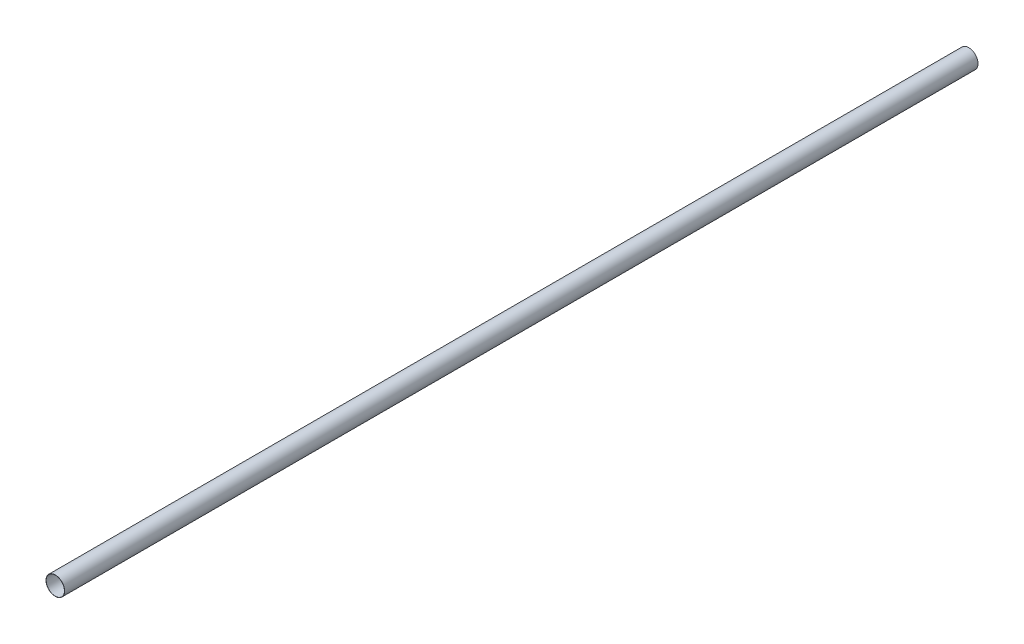
ISO-10303-21;
HEADER;
FILE_DESCRIPTION(('STEP AP214'),'2;1');
FILE_NAME('part.step','',(''),(''),'','','');
FILE_SCHEMA(('AUTOMOTIVE_DESIGN { 1 0 10303 214 1 1 1 1 }'));
ENDSEC;
DATA;
#1=APPLICATION_CONTEXT('core data for automotive mechanical design processes');
#2=APPLICATION_PROTOCOL_DEFINITION('international standard','automotive_design',2000,#1);
#3=PRODUCT_CONTEXT('',#1,'mechanical');
#4=PRODUCT('Part','Part','',(#3));
#5=PRODUCT_RELATED_PRODUCT_CATEGORY('part','',(#4));
#6=PRODUCT_DEFINITION_FORMATION('','',#4);
#7=PRODUCT_DEFINITION_CONTEXT('part definition',#1,'design');
#8=PRODUCT_DEFINITION('design','',#6,#7);
#9=PRODUCT_DEFINITION_SHAPE('','',#8);
#10=(LENGTH_UNIT() NAMED_UNIT(*) SI_UNIT(.MILLI.,.METRE.));
#11=(NAMED_UNIT(*) PLANE_ANGLE_UNIT() SI_UNIT($,.RADIAN.));
#12=(NAMED_UNIT(*) SI_UNIT($,.STERADIAN.) SOLID_ANGLE_UNIT());
#13=UNCERTAINTY_MEASURE_WITH_UNIT(LENGTH_MEASURE(1.E-05),#10,'distance_accuracy_value','');
#14=(GEOMETRIC_REPRESENTATION_CONTEXT(3) GLOBAL_UNCERTAINTY_ASSIGNED_CONTEXT((#13)) GLOBAL_UNIT_ASSIGNED_CONTEXT((#10,
#11,#12)) REPRESENTATION_CONTEXT('',''));
#15=CARTESIAN_POINT('',(0.,0.,0.));
#16=DIRECTION('',(0.,0.,1.));
#17=DIRECTION('',(1.,0.,0.));
#18=AXIS2_PLACEMENT_3D('',#15,#16,#17);
#19=CARTESIAN_POINT('',(0.,0.,5000.));
#20=DIRECTION('',(0.,0.,1.));
#21=DIRECTION('',(1.,0.,0.));
#22=AXIS2_PLACEMENT_3D('',#19,#20,#21);
#23=PLANE('',#22);
#24=CARTESIAN_POINT('',(0.,0.,5000.));
#25=DIRECTION('',(0.,0.,1.));
#26=DIRECTION('',(1.,0.,0.));
#27=AXIS2_PLACEMENT_3D('',#24,#25,#26);
#28=CIRCLE('',#27,51.);
#29=CARTESIAN_POINT('',(51.,0.,5000.));
#30=VERTEX_POINT('',#29);
#31=EDGE_CURVE('E10',#30,#30,#28,.T.);
#32=ORIENTED_EDGE('',*,*,#31,.T.);
#33=EDGE_LOOP('',(#32));
#34=FACE_BOUND('',#33,.T.);
#35=CARTESIAN_POINT('',(0.,0.,5000.));
#36=DIRECTION('',(0.,0.,1.));
#37=DIRECTION('',(1.,0.,0.));
#38=AXIS2_PLACEMENT_3D('',#35,#36,#37);
#39=CIRCLE('',#38,50.);
#40=CARTESIAN_POINT('',(50.,0.,5000.));
#41=VERTEX_POINT('',#40);
#42=EDGE_CURVE('E51',#41,#41,#39,.T.);
#43=ORIENTED_EDGE('',*,*,#42,.F.);
#44=EDGE_LOOP('',(#43));
#45=FACE_BOUND('',#44,.T.);
#46=ADVANCED_FACE('F40',(#34,#45),#23,.T.);
#47=CARTESIAN_POINT('',(0.,0.,0.));
#48=DIRECTION('',(0.,0.,1.));
#49=DIRECTION('',(1.,0.,0.));
#50=AXIS2_PLACEMENT_3D('',#47,#48,#49);
#51=PLANE('',#50);
#52=CARTESIAN_POINT('',(0.,0.,0.));
#53=DIRECTION('',(0.,0.,1.));
#54=DIRECTION('',(1.,0.,0.));
#55=AXIS2_PLACEMENT_3D('',#52,#53,#54);
#56=CIRCLE('',#55,51.);
#57=CARTESIAN_POINT('',(51.,0.,0.));
#58=VERTEX_POINT('',#57);
#59=EDGE_CURVE('E44',#58,#58,#56,.T.);
#60=ORIENTED_EDGE('',*,*,#59,.F.);
#61=EDGE_LOOP('',(#60));
#62=FACE_BOUND('',#61,.T.);
#63=CARTESIAN_POINT('',(0.,0.,0.));
#64=DIRECTION('',(0.,0.,1.));
#65=DIRECTION('',(1.,0.,0.));
#66=AXIS2_PLACEMENT_3D('',#63,#64,#65);
#67=CIRCLE('',#66,50.);
#68=CARTESIAN_POINT('',(50.,0.,0.));
#69=VERTEX_POINT('',#68);
#70=EDGE_CURVE('E53',#69,#69,#67,.T.);
#71=ORIENTED_EDGE('',*,*,#70,.T.);
#72=EDGE_LOOP('',(#71));
#73=FACE_BOUND('',#72,.T.);
#74=ADVANCED_FACE('F63',(#62,#73),#51,.F.);
#75=CARTESIAN_POINT('',(0.,0.,5000.));
#76=DIRECTION('',(0.,0.,-1.));
#77=DIRECTION('',(-1.,0.,0.));
#78=AXIS2_PLACEMENT_3D('',#75,#76,#77);
#79=CYLINDRICAL_SURFACE('',#78,51.);
#80=ORIENTED_EDGE('',*,*,#31,.F.);
#81=EDGE_LOOP('',(#80));
#82=FACE_BOUND('',#81,.T.);
#83=ORIENTED_EDGE('',*,*,#59,.T.);
#84=EDGE_LOOP('',(#83));
#85=FACE_BOUND('',#84,.T.);
#86=ADVANCED_FACE('F42',(#82,#85),#79,.T.);
#87=CARTESIAN_POINT('',(0.,0.,5000.));
#88=DIRECTION('',(0.,0.,-1.));
#89=DIRECTION('',(-1.,0.,0.));
#90=AXIS2_PLACEMENT_3D('',#87,#88,#89);
#91=CYLINDRICAL_SURFACE('',#90,50.);
#92=ORIENTED_EDGE('',*,*,#42,.T.);
#93=EDGE_LOOP('',(#92));
#94=FACE_BOUND('',#93,.T.);
#95=ORIENTED_EDGE('',*,*,#70,.F.);
#96=EDGE_LOOP('',(#95));
#97=FACE_BOUND('',#96,.T.);
#98=ADVANCED_FACE('F59',(#94,#97),#91,.F.);
#99=CLOSED_SHELL('',(#46,#74,#86,#98));
#100=MANIFOLD_SOLID_BREP('B2',#99);
#101=ADVANCED_BREP_SHAPE_REPRESENTATION('',(#18,#100),#14);
#102=SHAPE_DEFINITION_REPRESENTATION(#9,#101);
ENDSEC;
END-ISO-10303-21;
